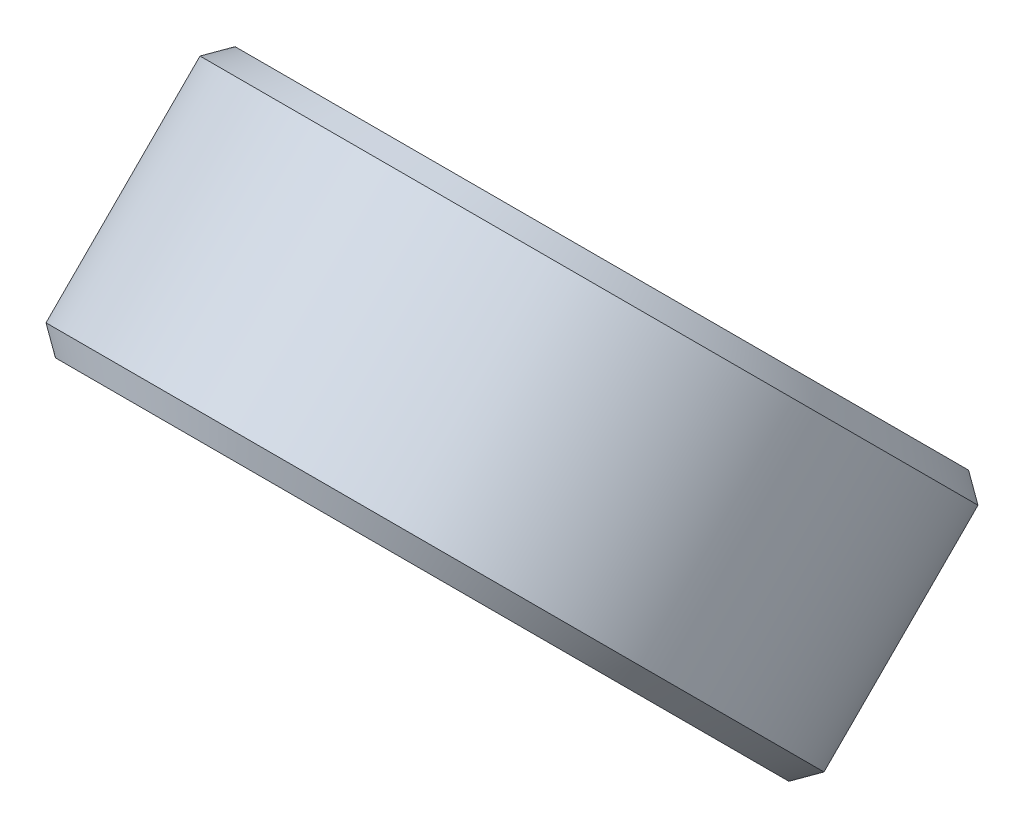
ISO-10303-21;
HEADER;
FILE_DESCRIPTION(('STEP AP214'),'2;1');
FILE_NAME('part.step','',(''),(''),'','','');
FILE_SCHEMA(('AUTOMOTIVE_DESIGN { 1 0 10303 214 1 1 1 1 }'));
ENDSEC;
DATA;
#1=APPLICATION_CONTEXT('core data for automotive mechanical design processes');
#2=APPLICATION_PROTOCOL_DEFINITION('international standard','automotive_design',2000,#1);
#3=PRODUCT_CONTEXT('',#1,'mechanical');
#4=PRODUCT('Part','Part','',(#3));
#5=PRODUCT_RELATED_PRODUCT_CATEGORY('part','',(#4));
#6=PRODUCT_DEFINITION_FORMATION('','',#4);
#7=PRODUCT_DEFINITION_CONTEXT('part definition',#1,'design');
#8=PRODUCT_DEFINITION('design','',#6,#7);
#9=PRODUCT_DEFINITION_SHAPE('','',#8);
#10=(LENGTH_UNIT() NAMED_UNIT(*) SI_UNIT(.MILLI.,.METRE.));
#11=(NAMED_UNIT(*) PLANE_ANGLE_UNIT() SI_UNIT($,.RADIAN.));
#12=(NAMED_UNIT(*) SI_UNIT($,.STERADIAN.) SOLID_ANGLE_UNIT());
#13=UNCERTAINTY_MEASURE_WITH_UNIT(LENGTH_MEASURE(1.E-05),#10,'distance_accuracy_value','');
#14=(GEOMETRIC_REPRESENTATION_CONTEXT(3) GLOBAL_UNCERTAINTY_ASSIGNED_CONTEXT((#13)) GLOBAL_UNIT_ASSIGNED_CONTEXT((#10,
#11,#12)) REPRESENTATION_CONTEXT('',''));
#15=CARTESIAN_POINT('',(0.,0.,0.));
#16=DIRECTION('',(0.,0.,1.));
#17=DIRECTION('',(1.,0.,0.));
#18=AXIS2_PLACEMENT_3D('',#15,#16,#17);
#19=CARTESIAN_POINT('',(0.,176.776695296637,176.776695296637));
#20=DIRECTION('',(0.,0.707106781186544,-0.707106781186552));
#21=DIRECTION('',(0.,0.707106781186552,0.707106781186544));
#22=AXIS2_PLACEMENT_3D('',#19,#20,#21);
#23=CYLINDRICAL_SURFACE('',#22,13.4999999999989);
#24=CARTESIAN_POINT('',(0.,36.2392225358109,317.314168057464));
#25=DIRECTION('',(0.,0.707106781186544,-0.707106781186552));
#26=DIRECTION('',(0.,0.707106781186552,0.707106781186544));
#27=AXIS2_PLACEMENT_3D('',#24,#25,#26);
#28=CIRCLE('',#27,13.4999999999988);
#29=CARTESIAN_POINT('',(-4.86691280225608,45.1432429697275,326.218188491381));
#30=VERTEX_POINT('',#29);
#31=CARTESIAN_POINT('',(4.86691280225606,45.1432429697275,326.218188491381));
#32=VERTEX_POINT('',#31);
#33=EDGE_CURVE('E230',#30,#32,#28,.T.);
#34=ORIENTED_EDGE('',*,*,#33,.T.);
#35=DIRECTION('',(0.,0.707106781186544,-0.707106781186552));
#36=VECTOR('',#35,1.);
#37=CARTESIAN_POINT('',(4.86691280225609,185.680715730554,185.680715730553));
#38=LINE('',#37,#36);
#39=CARTESIAN_POINT('',(4.86691280225607,36.6579615954889,334.703469865619));
#40=VERTEX_POINT('',#39);
#41=EDGE_CURVE('E152',#32,#40,#38,.F.);
#42=ORIENTED_EDGE('',*,*,#41,.T.);
#43=CARTESIAN_POINT('',(0.,27.7539411615724,325.799449431703));
#44=DIRECTION('',(0.,0.707106781186544,-0.707106781186552));
#45=DIRECTION('',(0.,0.707106781186552,0.707106781186544));
#46=AXIS2_PLACEMENT_3D('',#43,#44,#45);
#47=CIRCLE('',#46,13.4999999999989);
#48=CARTESIAN_POINT('',(-4.86691280225607,36.6579615954889,334.703469865619));
#49=VERTEX_POINT('',#48);
#50=EDGE_CURVE('E218',#49,#40,#47,.T.);
#51=ORIENTED_EDGE('',*,*,#50,.F.);
#52=DIRECTION('',(0.,0.707106781186544,-0.707106781186552));
#53=VECTOR('',#52,1.);
#54=CARTESIAN_POINT('',(-4.86691280225608,185.680715730554,185.680715730553));
#55=LINE('',#54,#53);
#56=EDGE_CURVE('E149',#49,#30,#55,.T.);
#57=ORIENTED_EDGE('',*,*,#56,.T.);
#58=EDGE_LOOP('',(#34,#42,#51,#57));
#59=FACE_BOUND('',#58,.T.);
#60=ADVANCED_FACE('F39',(#59),#23,.F.);
#61=CARTESIAN_POINT('',(10.4800583067826,33.7713483227344,331.816856592865));
#62=VERTEX_POINT('',#61);
#63=CARTESIAN_POINT('',(10.4800583067826,21.7365340004104,319.782042270541));
#64=VERTEX_POINT('',#63);
#65=EDGE_CURVE('E228',#62,#64,#47,.T.);
#66=ORIENTED_EDGE('',*,*,#65,.F.);
#67=DIRECTION('',(0.,0.707106781186544,-0.707106781186552));
#68=VECTOR('',#67,1.);
#69=CARTESIAN_POINT('',(10.4800583067826,182.794102457799,182.794102457799));
#70=LINE('',#69,#68);
#71=CARTESIAN_POINT('',(10.4800583067825,42.256629696973,323.331575218626));
#72=VERTEX_POINT('',#71);
#73=EDGE_CURVE('E135',#62,#72,#70,.T.);
#74=ORIENTED_EDGE('',*,*,#73,.T.);
#75=CARTESIAN_POINT('',(10.4800583067826,30.221815374649,311.296760896302));
#76=VERTEX_POINT('',#75);
#77=EDGE_CURVE('E232',#72,#76,#28,.T.);
#78=ORIENTED_EDGE('',*,*,#77,.T.);
#79=DIRECTION('',(0.,0.707106781186544,-0.707106781186552));
#80=VECTOR('',#79,1.);
#81=CARTESIAN_POINT('',(10.4800583067826,170.759288135475,170.759288135475));
#82=LINE('',#81,#80);
#83=EDGE_CURVE('E132',#76,#64,#82,.F.);
#84=ORIENTED_EDGE('',*,*,#83,.T.);
#85=EDGE_LOOP('',(#66,#74,#78,#84));
#86=FACE_BOUND('',#85,.T.);
#87=ADVANCED_FACE('F411',(#86),#23,.F.);
#88=CARTESIAN_POINT('',(4.86691280225619,27.3352021018944,308.410147623548));
#89=VERTEX_POINT('',#88);
#90=CARTESIAN_POINT('',(-4.86691280225618,27.3352021018944,308.410147623548));
#91=VERTEX_POINT('',#90);
#92=EDGE_CURVE('E121',#89,#91,#28,.T.);
#93=ORIENTED_EDGE('',*,*,#92,.T.);
#94=DIRECTION('',(0.,0.707106781186544,-0.707106781186552));
#95=VECTOR('',#94,1.);
#96=CARTESIAN_POINT('',(-4.86691280225618,167.872674862721,167.87267486272));
#97=LINE('',#96,#95);
#98=CARTESIAN_POINT('',(-4.86691280225618,18.8499207276559,316.895428997787));
#99=VERTEX_POINT('',#98);
#100=EDGE_CURVE('E137',#91,#99,#97,.F.);
#101=ORIENTED_EDGE('',*,*,#100,.T.);
#102=CARTESIAN_POINT('',(4.86691280225619,18.8499207276559,316.895428997787));
#103=VERTEX_POINT('',#102);
#104=EDGE_CURVE('E225',#103,#99,#47,.T.);
#105=ORIENTED_EDGE('',*,*,#104,.F.);
#106=DIRECTION('',(0.,0.707106781186544,-0.707106781186552));
#107=VECTOR('',#106,1.);
#108=CARTESIAN_POINT('',(4.86691280225619,167.872674862721,167.87267486272));
#109=LINE('',#108,#107);
#110=EDGE_CURVE('E275',#103,#89,#109,.T.);
#111=ORIENTED_EDGE('',*,*,#110,.T.);
#112=EDGE_LOOP('',(#93,#101,#105,#111));
#113=FACE_BOUND('',#112,.T.);
#114=ADVANCED_FACE('F281',(#113),#23,.F.);
#115=CARTESIAN_POINT('',(0.,-140.537472760829,140.537472760826));
#116=DIRECTION('',(0.,0.707106781186544,-0.707106781186552));
#117=DIRECTION('',(0.,0.707106781186552,0.707106781186544));
#118=AXIS2_PLACEMENT_3D('',#115,#116,#117);
#119=PLANE('',#118);
#120=CARTESIAN_POINT('',(0.,36.2392225358101,317.314168057464));
#121=DIRECTION('',(0.,0.707106781186544,-0.707106781186552));
#122=DIRECTION('',(0.,0.707106781186552,0.707106781186544));
#123=AXIS2_PLACEMENT_3D('',#120,#121,#122);
#124=CIRCLE('',#123,10.5000000000001);
#125=CARTESIAN_POINT('',(0.,43.6638437382689,324.738789259922));
#126=VERTEX_POINT('',#125);
#127=EDGE_CURVE('E215',#126,#126,#124,.F.);
#128=ORIENTED_EDGE('',*,*,#127,.F.);
#129=EDGE_LOOP('',(#128));
#130=FACE_BOUND('',#129,.T.);
#131=ORIENTED_EDGE('',*,*,#33,.F.);
#132=CARTESIAN_POINT('',(-5.22742486168249,45.8028000389066,326.87774556056));
#133=DIRECTION('',(0.,0.707106781186544,-0.707106781186552));
#134=DIRECTION('',(0.,0.707106781186552,0.707106781186544));
#135=AXIS2_PLACEMENT_3D('',#132,#133,#134);
#136=CIRCLE('',#135,1.);
#137=CARTESIAN_POINT('',(-5.96677823190049,45.3266925962283,326.401638117882));
#138=VERTEX_POINT('',#137);
#139=EDGE_CURVE('E168',#30,#138,#136,.T.);
#140=ORIENTED_EDGE('',*,*,#139,.T.);
#141=CARTESIAN_POINT('',(-8.00000000000001,44.017397128863,325.092342650516));
#142=DIRECTION('',(0.,-0.707106781186543,0.707106781186552));
#143=DIRECTION('',(0.,-0.707106781186552,-0.707106781186543));
#144=AXIS2_PLACEMENT_3D('',#141,#142,#143);
#145=CIRCLE('',#144,2.75);
#146=CARTESIAN_POINT('',(-10.3879965428732,43.0530391789229,324.127984700576));
#147=VERTEX_POINT('',#146);
#148=EDGE_CURVE('E56',#147,#138,#145,.T.);
#149=ORIENTED_EDGE('',*,*,#148,.F.);
#150=CARTESIAN_POINT('',(-11.2563589220998,42.7023635607628,323.777309082416));
#151=DIRECTION('',(0.,0.707106781186544,-0.707106781186552));
#152=DIRECTION('',(0.,0.707106781186552,0.707106781186544));
#153=AXIS2_PLACEMENT_3D('',#150,#151,#152);
#154=CIRCLE('',#153,1.);
#155=CARTESIAN_POINT('',(-10.4800583067825,42.256629696973,323.331575218626));
#156=VERTEX_POINT('',#155);
#157=EDGE_CURVE('E170',#147,#156,#154,.T.);
#158=ORIENTED_EDGE('',*,*,#157,.T.);
#159=CARTESIAN_POINT('',(-10.4800583067826,30.2218153746489,311.296760896302));
#160=VERTEX_POINT('',#159);
#161=EDGE_CURVE('E231',#160,#156,#28,.T.);
#162=ORIENTED_EDGE('',*,*,#161,.F.);
#163=CARTESIAN_POINT('',(-11.2563589220998,29.7760815108591,310.851027032513));
#164=DIRECTION('',(0.,0.707106781186544,-0.707106781186552));
#165=DIRECTION('',(0.,0.707106781186552,0.707106781186544));
#166=AXIS2_PLACEMENT_3D('',#163,#164,#165);
#167=CIRCLE('',#166,1.);
#168=CARTESIAN_POINT('',(-10.3879965428732,29.4254058926991,310.500351414353));
#169=VERTEX_POINT('',#168);
#170=EDGE_CURVE('E161',#160,#169,#167,.T.);
#171=ORIENTED_EDGE('',*,*,#170,.T.);
#172=CARTESIAN_POINT('',(-7.99999999999998,28.4610479427589,309.535993464412));
#173=DIRECTION('',(0.,-0.707106781186543,0.707106781186552));
#174=DIRECTION('',(0.,-0.707106781186552,-0.707106781186543));
#175=AXIS2_PLACEMENT_3D('',#172,#173,#174);
#176=CIRCLE('',#175,2.75);
#177=CARTESIAN_POINT('',(-5.96677823190056,27.1517524753936,308.226697997047));
#178=VERTEX_POINT('',#177);
#179=EDGE_CURVE('E303',#178,#169,#176,.T.);
#180=ORIENTED_EDGE('',*,*,#179,.F.);
#181=CARTESIAN_POINT('',(-5.22742486168259,26.6756450327154,307.750590554369));
#182=DIRECTION('',(0.,0.707106781186544,-0.707106781186552));
#183=DIRECTION('',(0.,0.707106781186552,0.707106781186544));
#184=AXIS2_PLACEMENT_3D('',#181,#182,#183);
#185=CIRCLE('',#184,1.);
#186=EDGE_CURVE('E126',#178,#91,#185,.T.);
#187=ORIENTED_EDGE('',*,*,#186,.T.);
#188=ORIENTED_EDGE('',*,*,#92,.F.);
#189=CARTESIAN_POINT('',(5.2274248616826,26.6756450327154,307.750590554369));
#190=DIRECTION('',(0.,0.707106781186544,-0.707106781186552));
#191=DIRECTION('',(0.,0.707106781186552,0.707106781186544));
#192=AXIS2_PLACEMENT_3D('',#189,#190,#191);
#193=CIRCLE('',#192,1.);
#194=CARTESIAN_POINT('',(5.96677823190057,27.1517524753937,308.226697997047));
#195=VERTEX_POINT('',#194);
#196=EDGE_CURVE('E116',#89,#195,#193,.T.);
#197=ORIENTED_EDGE('',*,*,#196,.T.);
#198=CARTESIAN_POINT('',(8.00000000000004,28.4610479427589,309.535993464412));
#199=DIRECTION('',(0.,-0.707106781186543,0.707106781186552));
#200=DIRECTION('',(0.,-0.707106781186552,-0.707106781186543));
#201=AXIS2_PLACEMENT_3D('',#198,#199,#200);
#202=CIRCLE('',#201,2.75);
#203=CARTESIAN_POINT('',(10.3879965428733,29.4254058926991,310.500351414353));
#204=VERTEX_POINT('',#203);
#205=EDGE_CURVE('E93',#204,#195,#202,.T.);
#206=ORIENTED_EDGE('',*,*,#205,.F.);
#207=CARTESIAN_POINT('',(11.2563589220999,29.7760815108592,310.851027032513));
#208=DIRECTION('',(0.,0.707106781186544,-0.707106781186552));
#209=DIRECTION('',(0.,0.707106781186552,0.707106781186544));
#210=AXIS2_PLACEMENT_3D('',#207,#208,#209);
#211=CIRCLE('',#210,1.);
#212=EDGE_CURVE('E172',#204,#76,#211,.T.);
#213=ORIENTED_EDGE('',*,*,#212,.T.);
#214=ORIENTED_EDGE('',*,*,#77,.F.);
#215=CARTESIAN_POINT('',(11.2563589220998,42.7023635607628,323.777309082416));
#216=DIRECTION('',(0.,0.707106781186544,-0.707106781186552));
#217=DIRECTION('',(0.,0.707106781186552,0.707106781186544));
#218=AXIS2_PLACEMENT_3D('',#215,#216,#217);
#219=CIRCLE('',#218,1.);
#220=CARTESIAN_POINT('',(10.3879965428732,43.0530391789229,324.127984700576));
#221=VERTEX_POINT('',#220);
#222=EDGE_CURVE('E125',#72,#221,#219,.T.);
#223=ORIENTED_EDGE('',*,*,#222,.T.);
#224=CARTESIAN_POINT('',(8.00000000000001,44.017397128863,325.092342650516));
#225=DIRECTION('',(0.,-0.707106781186543,0.707106781186552));
#226=DIRECTION('',(0.,-0.707106781186552,-0.707106781186543));
#227=AXIS2_PLACEMENT_3D('',#224,#225,#226);
#228=CIRCLE('',#227,2.75);
#229=CARTESIAN_POINT('',(5.96677823190047,45.3266925962283,326.401638117882));
#230=VERTEX_POINT('',#229);
#231=EDGE_CURVE('E239',#230,#221,#228,.T.);
#232=ORIENTED_EDGE('',*,*,#231,.F.);
#233=CARTESIAN_POINT('',(5.22742486168248,45.8028000389065,326.87774556056));
#234=DIRECTION('',(0.,0.707106781186544,-0.707106781186552));
#235=DIRECTION('',(0.,0.707106781186552,0.707106781186544));
#236=AXIS2_PLACEMENT_3D('',#233,#234,#235);
#237=CIRCLE('',#236,1.);
#238=EDGE_CURVE('E78',#230,#32,#237,.T.);
#239=ORIENTED_EDGE('',*,*,#238,.T.);
#240=EDGE_LOOP('',(#131,#140,#149,#158,#162,#171,#180,#187,#188,#197,#206,#213,#214,#223,#232,#239));
#241=FACE_BOUND('',#240,.T.);
#242=ADVANCED_FACE('F117',(#130,#241),#119,.F.);
#243=CARTESIAN_POINT('',(-10.4800583067826,21.7365340004104,319.782042270541));
#244=VERTEX_POINT('',#243);
#245=CARTESIAN_POINT('',(-10.4800583067825,33.7713483227344,331.816856592865));
#246=VERTEX_POINT('',#245);
#247=EDGE_CURVE('E229',#244,#246,#47,.T.);
#248=ORIENTED_EDGE('',*,*,#247,.F.);
#249=DIRECTION('',(0.,0.707106781186544,-0.707106781186552));
#250=VECTOR('',#249,1.);
#251=CARTESIAN_POINT('',(-10.4800583067826,170.759288135475,170.759288135475));
#252=LINE('',#251,#250);
#253=EDGE_CURVE('E244',#244,#160,#252,.T.);
#254=ORIENTED_EDGE('',*,*,#253,.T.);
#255=ORIENTED_EDGE('',*,*,#161,.T.);
#256=DIRECTION('',(0.,0.707106781186544,-0.707106781186552));
#257=VECTOR('',#256,1.);
#258=CARTESIAN_POINT('',(-10.4800583067825,182.794102457799,182.794102457799));
#259=LINE('',#258,#257);
#260=EDGE_CURVE('E241',#156,#246,#259,.F.);
#261=ORIENTED_EDGE('',*,*,#260,.T.);
#262=EDGE_LOOP('',(#248,#254,#255,#261));
#263=FACE_BOUND('',#262,.T.);
#264=ADVANCED_FACE('F194',(#263),#23,.F.);
#265=CARTESIAN_POINT('',(0.,-139.123259198454,139.123259198455));
#266=DIRECTION('',(0.,0.707106781186544,-0.707106781186552));
#267=DIRECTION('',(0.,0.707106781186552,0.707106781186544));
#268=AXIS2_PLACEMENT_3D('',#265,#266,#267);
#269=PLANE('',#268);
#270=CARTESIAN_POINT('',(0.,37.653436098184,315.899954495091));
#271=DIRECTION('',(0.,0.707106781186544,-0.707106781186552));
#272=DIRECTION('',(0.,0.707106781186552,0.707106781186544));
#273=AXIS2_PLACEMENT_3D('',#270,#271,#272);
#274=CIRCLE('',#273,16.4999999999993);
#275=CARTESIAN_POINT('',(0.,49.3206979877616,327.567216384669));
#276=VERTEX_POINT('',#275);
#277=EDGE_CURVE('E174',#276,#276,#274,.T.);
#278=ORIENTED_EDGE('',*,*,#277,.T.);
#279=EDGE_LOOP('',(#278));
#280=FACE_BOUND('',#279,.T.);
#281=CARTESIAN_POINT('',(-8.00000000000001,45.4316106912362,323.678129088143));
#282=DIRECTION('',(0.,0.707106781186544,-0.707106781186552));
#283=DIRECTION('',(0.,0.707106781186552,0.707106781186544));
#284=AXIS2_PLACEMENT_3D('',#281,#282,#283);
#285=CIRCLE('',#284,1.35);
#286=CARTESIAN_POINT('',(-8.00000000000001,46.386204845838,324.632723242745));
#287=VERTEX_POINT('',#286);
#288=EDGE_CURVE('E199',#287,#287,#285,.T.);
#289=ORIENTED_EDGE('',*,*,#288,.F.);
#290=EDGE_LOOP('',(#289));
#291=FACE_BOUND('',#290,.T.);
#292=CARTESIAN_POINT('',(8.00000000000001,45.4316106912362,323.678129088143));
#293=DIRECTION('',(0.,0.707106781186544,-0.707106781186552));
#294=DIRECTION('',(0.,0.707106781186552,0.707106781186544));
#295=AXIS2_PLACEMENT_3D('',#292,#293,#294);
#296=CIRCLE('',#295,1.35);
#297=CARTESIAN_POINT('',(8.00000000000001,46.386204845838,324.632723242745));
#298=VERTEX_POINT('',#297);
#299=EDGE_CURVE('E113',#298,#298,#296,.T.);
#300=ORIENTED_EDGE('',*,*,#299,.F.);
#301=EDGE_LOOP('',(#300));
#302=FACE_BOUND('',#301,.T.);
#303=CARTESIAN_POINT('',(8.00000000000004,29.875261505132,308.121779902039));
#304=DIRECTION('',(0.,0.707106781186544,-0.707106781186552));
#305=DIRECTION('',(0.,0.707106781186552,0.707106781186544));
#306=AXIS2_PLACEMENT_3D('',#303,#304,#305);
#307=CIRCLE('',#306,1.35);
#308=CARTESIAN_POINT('',(8.00000000000004,30.8298556597339,309.076374056641));
#309=VERTEX_POINT('',#308);
#310=EDGE_CURVE('E206',#309,#309,#307,.T.);
#311=ORIENTED_EDGE('',*,*,#310,.F.);
#312=EDGE_LOOP('',(#311));
#313=FACE_BOUND('',#312,.T.);
#314=CARTESIAN_POINT('',(-7.99999999999998,29.875261505132,308.121779902039));
#315=DIRECTION('',(0.,0.707106781186544,-0.707106781186552));
#316=DIRECTION('',(0.,0.707106781186552,0.707106781186544));
#317=AXIS2_PLACEMENT_3D('',#314,#315,#316);
#318=CIRCLE('',#317,1.35);
#319=CARTESIAN_POINT('',(-7.99999999999998,30.8298556597339,309.076374056641));
#320=VERTEX_POINT('',#319);
#321=EDGE_CURVE('E210',#320,#320,#318,.T.);
#322=ORIENTED_EDGE('',*,*,#321,.F.);
#323=EDGE_LOOP('',(#322));
#324=FACE_BOUND('',#323,.T.);
#325=CARTESIAN_POINT('',(0.,37.6534360981832,315.89995449509));
#326=DIRECTION('',(0.,0.707106781186543,-0.707106781186552));
#327=DIRECTION('',(0.,0.707106781186552,0.707106781186543));
#328=AXIS2_PLACEMENT_3D('',#325,#326,#327);
#329=CIRCLE('',#328,10.5000000000001);
#330=CARTESIAN_POINT('',(0.,45.0780573006421,323.324575697549));
#331=VERTEX_POINT('',#330);
#332=EDGE_CURVE('E213',#331,#331,#329,.T.);
#333=ORIENTED_EDGE('',*,*,#332,.F.);
#334=EDGE_LOOP('',(#333));
#335=FACE_BOUND('',#334,.T.);
#336=ADVANCED_FACE('F191',(#280,#291,#302,#313,#324,#335),#269,.T.);
#337=CARTESIAN_POINT('',(0.,176.776695296637,176.776695296637));
#338=DIRECTION('',(0.,0.707106781186544,-0.707106781186552));
#339=DIRECTION('',(0.,0.707106781186552,0.707106781186544));
#340=AXIS2_PLACEMENT_3D('',#337,#338,#339);
#341=CYLINDRICAL_SURFACE('',#340,17.4999999999989);
#342=CARTESIAN_POINT('',(0.,36.9463293169975,316.607061276278));
#343=DIRECTION('',(0.,0.707106781186534,-0.707106781186561));
#344=DIRECTION('',(0.,0.707106781186561,0.707106781186534));
#345=AXIS2_PLACEMENT_3D('',#342,#343,#344);
#346=CIRCLE('',#345,17.4999999999989);
#347=CARTESIAN_POINT('',(0.,49.3206979877616,328.981429947041));
#348=VERTEX_POINT('',#347);
#349=EDGE_CURVE('E49',#348,#348,#346,.F.);
#350=ORIENTED_EDGE('',*,*,#349,.T.);
#351=EDGE_LOOP('',(#350));
#352=FACE_BOUND('',#351,.T.);
#353=CARTESIAN_POINT('',(0.,28.461047942759,325.092342650516));
#354=DIRECTION('',(0.,0.707106781186575,-0.70710678118652));
#355=DIRECTION('',(0.,0.70710678118652,0.707106781186575));
#356=AXIS2_PLACEMENT_3D('',#353,#354,#355);
#357=CIRCLE('',#356,17.4999999999989);
#358=CARTESIAN_POINT('',(0.,40.8354166135223,337.466711321281));
#359=VERTEX_POINT('',#358);
#360=EDGE_CURVE('E177',#359,#359,#357,.T.);
#361=ORIENTED_EDGE('',*,*,#360,.T.);
#362=EDGE_LOOP('',(#361));
#363=FACE_BOUND('',#362,.T.);
#364=ADVANCED_FACE('F182',(#352,#363),#341,.T.);
#365=CARTESIAN_POINT('',(0.,-149.022754135066,149.022754135066));
#366=DIRECTION('',(0.,0.707106781186544,-0.707106781186552));
#367=DIRECTION('',(0.,0.707106781186552,0.707106781186544));
#368=AXIS2_PLACEMENT_3D('',#365,#366,#367);
#369=PLANE('',#368);
#370=CARTESIAN_POINT('',(0.,27.7539411615724,325.799449431703));
#371=DIRECTION('',(0.,0.707106781186544,-0.707106781186552));
#372=DIRECTION('',(0.,0.707106781186552,0.707106781186544));
#373=AXIS2_PLACEMENT_3D('',#370,#371,#372);
#374=CIRCLE('',#373,16.4999999999995);
#375=CARTESIAN_POINT('',(0.,39.4212030511501,337.466711321281));
#376=VERTEX_POINT('',#375);
#377=EDGE_CURVE('E11',#376,#376,#374,.F.);
#378=ORIENTED_EDGE('',*,*,#377,.T.);
#379=EDGE_LOOP('',(#378));
#380=FACE_BOUND('',#379,.T.);
#381=CARTESIAN_POINT('',(-7.99999999999998,19.9757665685204,318.021274838651));
#382=DIRECTION('',(0.,0.707106781186544,-0.707106781186552));
#383=DIRECTION('',(0.,0.707106781186552,0.707106781186544));
#384=AXIS2_PLACEMENT_3D('',#381,#382,#383);
#385=CIRCLE('',#384,2.74999999999997);
#386=CARTESIAN_POINT('',(-5.96677823190058,18.6664711011551,316.711979371286));
#387=VERTEX_POINT('',#386);
#388=CARTESIAN_POINT('',(-10.3879965428732,20.9401245184606,318.985632788591));
#389=VERTEX_POINT('',#388);
#390=EDGE_CURVE('E300',#387,#389,#385,.T.);
#391=ORIENTED_EDGE('',*,*,#390,.T.);
#392=CARTESIAN_POINT('',(-11.2563589220998,21.2908001366206,319.336308406751));
#393=DIRECTION('',(0.,0.707106781186544,-0.707106781186552));
#394=DIRECTION('',(0.,0.707106781186552,0.707106781186544));
#395=AXIS2_PLACEMENT_3D('',#392,#393,#394);
#396=CIRCLE('',#395,1.);
#397=EDGE_CURVE('E272',#389,#244,#396,.F.);
#398=ORIENTED_EDGE('',*,*,#397,.T.);
#399=ORIENTED_EDGE('',*,*,#247,.T.);
#400=CARTESIAN_POINT('',(-11.2563589220998,34.2170821865243,332.262590456655));
#401=DIRECTION('',(0.,0.707106781186544,-0.707106781186552));
#402=DIRECTION('',(0.,0.707106781186552,0.707106781186544));
#403=AXIS2_PLACEMENT_3D('',#400,#401,#402);
#404=CIRCLE('',#403,1.);
#405=CARTESIAN_POINT('',(-10.3879965428732,34.5677578046843,332.613266074815));
#406=VERTEX_POINT('',#405);
#407=EDGE_CURVE('E256',#246,#406,#404,.F.);
#408=ORIENTED_EDGE('',*,*,#407,.T.);
#409=CARTESIAN_POINT('',(-8.00000000000001,35.5321157546245,333.577624024755));
#410=DIRECTION('',(0.,0.707106781186544,-0.707106781186552));
#411=DIRECTION('',(0.,0.707106781186552,0.707106781186544));
#412=AXIS2_PLACEMENT_3D('',#409,#410,#411);
#413=CIRCLE('',#412,2.75000000000001);
#414=CARTESIAN_POINT('',(-5.9667782319005,36.8414112219898,334.88691949212));
#415=VERTEX_POINT('',#414);
#416=EDGE_CURVE('E322',#406,#415,#413,.T.);
#417=ORIENTED_EDGE('',*,*,#416,.T.);
#418=CARTESIAN_POINT('',(-5.22742486168249,37.317518664668,335.363026934799));
#419=DIRECTION('',(0.,0.707106781186544,-0.707106781186552));
#420=DIRECTION('',(0.,0.707106781186552,0.707106781186544));
#421=AXIS2_PLACEMENT_3D('',#418,#419,#420);
#422=CIRCLE('',#421,1.);
#423=EDGE_CURVE('E259',#415,#49,#422,.F.);
#424=ORIENTED_EDGE('',*,*,#423,.T.);
#425=ORIENTED_EDGE('',*,*,#50,.T.);
#426=CARTESIAN_POINT('',(5.22742486168248,37.317518664668,335.363026934798));
#427=DIRECTION('',(0.,0.707106781186544,-0.707106781186552));
#428=DIRECTION('',(0.,0.707106781186552,0.707106781186544));
#429=AXIS2_PLACEMENT_3D('',#426,#427,#428);
#430=CIRCLE('',#429,1.);
#431=CARTESIAN_POINT('',(5.9667782319005,36.8414112219898,334.88691949212));
#432=VERTEX_POINT('',#431);
#433=EDGE_CURVE('E262',#40,#432,#430,.F.);
#434=ORIENTED_EDGE('',*,*,#433,.T.);
#435=CARTESIAN_POINT('',(8.00000000000001,35.5321157546245,333.577624024755));
#436=DIRECTION('',(0.,0.707106781186544,-0.707106781186552));
#437=DIRECTION('',(0.,0.707106781186552,0.707106781186544));
#438=AXIS2_PLACEMENT_3D('',#435,#436,#437);
#439=CIRCLE('',#438,2.75);
#440=CARTESIAN_POINT('',(10.3879965428732,34.5677578046844,332.613266074815));
#441=VERTEX_POINT('',#440);
#442=EDGE_CURVE('E319',#432,#441,#439,.T.);
#443=ORIENTED_EDGE('',*,*,#442,.T.);
#444=CARTESIAN_POINT('',(11.2563589220998,34.2170821865243,332.262590456655));
#445=DIRECTION('',(0.,0.707106781186544,-0.707106781186552));
#446=DIRECTION('',(0.,0.707106781186552,0.707106781186544));
#447=AXIS2_PLACEMENT_3D('',#444,#445,#446);
#448=CIRCLE('',#447,1.);
#449=EDGE_CURVE('E265',#441,#62,#448,.F.);
#450=ORIENTED_EDGE('',*,*,#449,.T.);
#451=ORIENTED_EDGE('',*,*,#65,.T.);
#452=CARTESIAN_POINT('',(11.2563589220999,21.2908001366206,319.336308406751));
#453=DIRECTION('',(0.,0.707106781186544,-0.707106781186552));
#454=DIRECTION('',(0.,0.707106781186552,0.707106781186544));
#455=AXIS2_PLACEMENT_3D('',#452,#453,#454);
#456=CIRCLE('',#455,1.);
#457=CARTESIAN_POINT('',(10.3879965428733,20.9401245184606,318.985632788591));
#458=VERTEX_POINT('',#457);
#459=EDGE_CURVE('E253',#64,#458,#456,.F.);
#460=ORIENTED_EDGE('',*,*,#459,.T.);
#461=CARTESIAN_POINT('',(8.00000000000004,19.9757665685204,318.021274838651));
#462=DIRECTION('',(0.,0.707106781186544,-0.707106781186552));
#463=DIRECTION('',(0.,0.707106781186552,0.707106781186544));
#464=AXIS2_PLACEMENT_3D('',#461,#462,#463);
#465=CIRCLE('',#464,2.74999999999999);
#466=CARTESIAN_POINT('',(5.96677823190056,18.6664711011552,316.711979371286));
#467=VERTEX_POINT('',#466);
#468=EDGE_CURVE('E317',#458,#467,#465,.T.);
#469=ORIENTED_EDGE('',*,*,#468,.T.);
#470=CARTESIAN_POINT('',(5.2274248616826,18.1903636584769,316.235871928608));
#471=DIRECTION('',(0.,0.707106781186544,-0.707106781186552));
#472=DIRECTION('',(0.,0.707106781186552,0.707106781186544));
#473=AXIS2_PLACEMENT_3D('',#470,#471,#472);
#474=CIRCLE('',#473,1.);
#475=EDGE_CURVE('E131',#467,#103,#474,.F.);
#476=ORIENTED_EDGE('',*,*,#475,.T.);
#477=ORIENTED_EDGE('',*,*,#104,.T.);
#478=CARTESIAN_POINT('',(-5.22742486168259,18.1903636584769,316.235871928608));
#479=DIRECTION('',(0.,0.707106781186544,-0.707106781186552));
#480=DIRECTION('',(0.,0.707106781186552,0.707106781186544));
#481=AXIS2_PLACEMENT_3D('',#478,#479,#480);
#482=CIRCLE('',#481,1.);
#483=EDGE_CURVE('E269',#99,#387,#482,.F.);
#484=ORIENTED_EDGE('',*,*,#483,.T.);
#485=EDGE_LOOP('',(#391,#398,#399,#408,#417,#424,#425,#434,#443,#450,#451,#460,#469,#476,#477,#484));
#486=FACE_BOUND('',#485,.T.);
#487=ADVANCED_FACE('F290',(#380,#486),#369,.F.);
#488=CARTESIAN_POINT('',(0.,1.23922253581244,352.314168057462));
#489=DIRECTION('',(0.,0.707106781186543,-0.707106781186552));
#490=DIRECTION('',(0.,0.707106781186552,0.707106781186543));
#491=AXIS2_PLACEMENT_3D('',#488,#489,#490);
#492=CYLINDRICAL_SURFACE('',#491,10.5000000000001);
#493=ORIENTED_EDGE('',*,*,#127,.T.);
#494=EDGE_LOOP('',(#493));
#495=FACE_BOUND('',#494,.T.);
#496=ORIENTED_EDGE('',*,*,#332,.T.);
#497=EDGE_LOOP('',(#496));
#498=FACE_BOUND('',#497,.T.);
#499=ADVANCED_FACE('F484',(#495,#498),#492,.F.);
#500=CARTESIAN_POINT('',(-7.99999999999998,28.4610479427589,309.535993464412));
#501=DIRECTION('',(0.,-0.707106781186543,0.707106781186552));
#502=DIRECTION('',(0.,-0.707106781186552,-0.707106781186543));
#503=AXIS2_PLACEMENT_3D('',#500,#501,#502);
#504=CYLINDRICAL_SURFACE('',#503,1.35);
#505=ORIENTED_EDGE('',*,*,#321,.T.);
#506=EDGE_LOOP('',(#505));
#507=FACE_BOUND('',#506,.T.);
#508=CARTESIAN_POINT('',(-7.99999999999998,29.4509974364201,308.546043970751));
#509=DIRECTION('',(0.,-0.707106781186543,0.707106781186552));
#510=DIRECTION('',(0.,-0.707106781186552,-0.707106781186543));
#511=AXIS2_PLACEMENT_3D('',#508,#509,#510);
#512=CIRCLE('',#511,1.35);
#513=CARTESIAN_POINT('',(-7.99999999999998,28.4964032818183,307.59144981615));
#514=VERTEX_POINT('',#513);
#515=EDGE_CURVE('E220',#514,#514,#512,.T.);
#516=ORIENTED_EDGE('',*,*,#515,.T.);
#517=EDGE_LOOP('',(#516));
#518=FACE_BOUND('',#517,.T.);
#519=ADVANCED_FACE('F495',(#507,#518),#504,.F.);
#520=CARTESIAN_POINT('',(-7.99999999999998,28.4610479427589,309.535993464412));
#521=DIRECTION('',(0.,-0.707106781186543,0.707106781186552));
#522=DIRECTION('',(0.,-0.707106781186552,-0.707106781186543));
#523=AXIS2_PLACEMENT_3D('',#520,#521,#522);
#524=CONICAL_SURFACE('',#523,2.75,0.785398163397455);
#525=ORIENTED_EDGE('',*,*,#515,.F.);
#526=EDGE_LOOP('',(#525));
#527=FACE_BOUND('',#526,.T.);
#528=ORIENTED_EDGE('',*,*,#179,.T.);
#529=EDGE_CURVE('E235',#169,#178,#176,.T.);
#530=ORIENTED_EDGE('',*,*,#529,.T.);
#531=EDGE_LOOP('',(#528,#530));
#532=FACE_BOUND('',#531,.T.);
#533=ADVANCED_FACE('F302',(#527,#532),#524,.F.);
#534=CARTESIAN_POINT('',(8.00000000000004,28.4610479427589,309.535993464412));
#535=DIRECTION('',(0.,-0.707106781186543,0.707106781186552));
#536=DIRECTION('',(0.,-0.707106781186552,-0.707106781186543));
#537=AXIS2_PLACEMENT_3D('',#534,#535,#536);
#538=CYLINDRICAL_SURFACE('',#537,1.35);
#539=ORIENTED_EDGE('',*,*,#310,.T.);
#540=EDGE_LOOP('',(#539));
#541=FACE_BOUND('',#540,.T.);
#542=CARTESIAN_POINT('',(8.00000000000004,29.4509974364201,308.546043970751));
#543=DIRECTION('',(0.,-0.707106781186543,0.707106781186552));
#544=DIRECTION('',(0.,-0.707106781186552,-0.707106781186543));
#545=AXIS2_PLACEMENT_3D('',#542,#543,#544);
#546=CIRCLE('',#545,1.35);
#547=CARTESIAN_POINT('',(8.00000000000004,28.4964032818183,307.59144981615));
#548=VERTEX_POINT('',#547);
#549=EDGE_CURVE('E100',#548,#548,#546,.T.);
#550=ORIENTED_EDGE('',*,*,#549,.T.);
#551=EDGE_LOOP('',(#550));
#552=FACE_BOUND('',#551,.T.);
#553=ADVANCED_FACE('F515',(#541,#552),#538,.F.);
#554=CARTESIAN_POINT('',(8.00000000000004,28.4610479427589,309.535993464412));
#555=DIRECTION('',(0.,-0.707106781186543,0.707106781186552));
#556=DIRECTION('',(0.,-0.707106781186552,-0.707106781186543));
#557=AXIS2_PLACEMENT_3D('',#554,#555,#556);
#558=CONICAL_SURFACE('',#557,2.75,0.785398163397454);
#559=ORIENTED_EDGE('',*,*,#549,.F.);
#560=EDGE_LOOP('',(#559));
#561=FACE_BOUND('',#560,.T.);
#562=ORIENTED_EDGE('',*,*,#205,.T.);
#563=EDGE_CURVE('E96',#195,#204,#202,.T.);
#564=ORIENTED_EDGE('',*,*,#563,.T.);
#565=EDGE_LOOP('',(#562,#564));
#566=FACE_BOUND('',#565,.T.);
#567=ADVANCED_FACE('F95',(#561,#566),#558,.F.);
#568=CARTESIAN_POINT('',(8.00000000000001,44.017397128863,325.092342650516));
#569=DIRECTION('',(0.,-0.707106781186543,0.707106781186552));
#570=DIRECTION('',(0.,-0.707106781186552,-0.707106781186543));
#571=AXIS2_PLACEMENT_3D('',#568,#569,#570);
#572=CYLINDRICAL_SURFACE('',#571,1.35);
#573=ORIENTED_EDGE('',*,*,#299,.T.);
#574=EDGE_LOOP('',(#573));
#575=FACE_BOUND('',#574,.T.);
#576=CARTESIAN_POINT('',(8.00000000000001,45.0073466225242,324.102393156855));
#577=DIRECTION('',(0.,-0.707106781186543,0.707106781186552));
#578=DIRECTION('',(0.,-0.707106781186552,-0.707106781186543));
#579=AXIS2_PLACEMENT_3D('',#576,#577,#578);
#580=CIRCLE('',#579,1.35);
#581=CARTESIAN_POINT('',(8.00000000000001,44.0527524679224,323.147799002253));
#582=VERTEX_POINT('',#581);
#583=EDGE_CURVE('E237',#582,#582,#580,.T.);
#584=ORIENTED_EDGE('',*,*,#583,.T.);
#585=EDGE_LOOP('',(#584));
#586=FACE_BOUND('',#585,.T.);
#587=ADVANCED_FACE('F397',(#575,#586),#572,.F.);
#588=CARTESIAN_POINT('',(8.00000000000001,44.017397128863,325.092342650516));
#589=DIRECTION('',(0.,-0.707106781186543,0.707106781186552));
#590=DIRECTION('',(0.,-0.707106781186552,-0.707106781186543));
#591=AXIS2_PLACEMENT_3D('',#588,#589,#590);
#592=CONICAL_SURFACE('',#591,2.75,0.785398163397454);
#593=ORIENTED_EDGE('',*,*,#583,.F.);
#594=EDGE_LOOP('',(#593));
#595=FACE_BOUND('',#594,.T.);
#596=ORIENTED_EDGE('',*,*,#231,.T.);
#597=EDGE_CURVE('E309',#221,#230,#228,.T.);
#598=ORIENTED_EDGE('',*,*,#597,.T.);
#599=EDGE_LOOP('',(#596,#598));
#600=FACE_BOUND('',#599,.T.);
#601=ADVANCED_FACE('F394',(#595,#600),#592,.F.);
#602=CARTESIAN_POINT('',(-8.00000000000001,44.017397128863,325.092342650516));
#603=DIRECTION('',(0.,-0.707106781186543,0.707106781186552));
#604=DIRECTION('',(0.,-0.707106781186552,-0.707106781186543));
#605=AXIS2_PLACEMENT_3D('',#602,#603,#604);
#606=CYLINDRICAL_SURFACE('',#605,1.35);
#607=ORIENTED_EDGE('',*,*,#288,.T.);
#608=EDGE_LOOP('',(#607));
#609=FACE_BOUND('',#608,.T.);
#610=CARTESIAN_POINT('',(-8.00000000000001,45.0073466225242,324.102393156855));
#611=DIRECTION('',(0.,-0.707106781186543,0.707106781186552));
#612=DIRECTION('',(0.,-0.707106781186552,-0.707106781186543));
#613=AXIS2_PLACEMENT_3D('',#610,#611,#612);
#614=CIRCLE('',#613,1.35);
#615=CARTESIAN_POINT('',(-8.00000000000001,44.0527524679224,323.147799002253));
#616=VERTEX_POINT('',#615);
#617=EDGE_CURVE('E240',#616,#616,#614,.T.);
#618=ORIENTED_EDGE('',*,*,#617,.T.);
#619=EDGE_LOOP('',(#618));
#620=FACE_BOUND('',#619,.T.);
#621=ADVANCED_FACE('F396',(#609,#620),#606,.F.);
#622=CARTESIAN_POINT('',(-8.00000000000001,44.017397128863,325.092342650516));
#623=DIRECTION('',(0.,-0.707106781186543,0.707106781186552));
#624=DIRECTION('',(0.,-0.707106781186552,-0.707106781186543));
#625=AXIS2_PLACEMENT_3D('',#622,#623,#624);
#626=CONICAL_SURFACE('',#625,2.75,0.785398163397454);
#627=ORIENTED_EDGE('',*,*,#617,.F.);
#628=EDGE_LOOP('',(#627));
#629=FACE_BOUND('',#628,.T.);
#630=ORIENTED_EDGE('',*,*,#148,.T.);
#631=EDGE_CURVE('E314',#138,#147,#145,.T.);
#632=ORIENTED_EDGE('',*,*,#631,.T.);
#633=EDGE_LOOP('',(#630,#632));
#634=FACE_BOUND('',#633,.T.);
#635=ADVANCED_FACE('F404',(#629,#634),#626,.F.);
#636=CARTESIAN_POINT('',(-8.00000000000001,23.1577470838609,345.951992695519));
#637=DIRECTION('',(0.,0.707106781186544,-0.707106781186552));
#638=DIRECTION('',(0.,0.707106781186552,0.707106781186544));
#639=AXIS2_PLACEMENT_3D('',#636,#637,#638);
#640=CYLINDRICAL_SURFACE('',#639,2.75000000000001);
#641=ORIENTED_EDGE('',*,*,#631,.F.);
#642=DIRECTION('',(0.,0.707106781186544,-0.707106781186552));
#643=VECTOR('',#642,1.);
#644=CARTESIAN_POINT('',(-5.96677823190049,24.4670425512261,347.261288162884));
#645=LINE('',#644,#643);
#646=EDGE_CURVE('E158',#138,#415,#645,.F.);
#647=ORIENTED_EDGE('',*,*,#646,.T.);
#648=ORIENTED_EDGE('',*,*,#416,.F.);
#649=DIRECTION('',(0.,0.707106781186544,-0.707106781186552));
#650=VECTOR('',#649,1.);
#651=CARTESIAN_POINT('',(-10.3879965428732,22.1933891339207,344.987634745579));
#652=LINE('',#651,#650);
#653=EDGE_CURVE('E155',#406,#147,#652,.T.);
#654=ORIENTED_EDGE('',*,*,#653,.T.);
#655=EDGE_LOOP('',(#641,#647,#648,#654));
#656=FACE_BOUND('',#655,.T.);
#657=ADVANCED_FACE('F564',(#656),#640,.F.);
#658=CARTESIAN_POINT('',(8.00000000000001,23.1577470838609,345.951992695519));
#659=DIRECTION('',(0.,0.707106781186544,-0.707106781186552));
#660=DIRECTION('',(0.,0.707106781186552,0.707106781186544));
#661=AXIS2_PLACEMENT_3D('',#658,#659,#660);
#662=CYLINDRICAL_SURFACE('',#661,2.75);
#663=ORIENTED_EDGE('',*,*,#597,.F.);
#664=DIRECTION('',(0.,0.707106781186544,-0.707106781186552));
#665=VECTOR('',#664,1.);
#666=CARTESIAN_POINT('',(10.3879965428732,22.1933891339207,344.987634745579));
#667=LINE('',#666,#665);
#668=EDGE_CURVE('E146',#221,#441,#667,.F.);
#669=ORIENTED_EDGE('',*,*,#668,.T.);
#670=ORIENTED_EDGE('',*,*,#442,.F.);
#671=DIRECTION('',(0.,0.707106781186544,-0.707106781186552));
#672=VECTOR('',#671,1.);
#673=CARTESIAN_POINT('',(5.96677823190048,24.4670425512261,347.261288162884));
#674=LINE('',#673,#672);
#675=EDGE_CURVE('E143',#432,#230,#674,.T.);
#676=ORIENTED_EDGE('',*,*,#675,.T.);
#677=EDGE_LOOP('',(#663,#669,#670,#676));
#678=FACE_BOUND('',#677,.T.);
#679=ADVANCED_FACE('F393',(#678),#662,.F.);
#680=CARTESIAN_POINT('',(8.00000000000004,7.60139789775679,330.395643509415));
#681=DIRECTION('',(0.,0.707106781186544,-0.707106781186552));
#682=DIRECTION('',(0.,0.707106781186552,0.707106781186544));
#683=AXIS2_PLACEMENT_3D('',#680,#681,#682);
#684=CYLINDRICAL_SURFACE('',#683,2.74999999999999);
#685=ORIENTED_EDGE('',*,*,#563,.F.);
#686=DIRECTION('',(0.,0.707106781186544,-0.707106781186552));
#687=VECTOR('',#686,1.);
#688=CARTESIAN_POINT('',(5.96677823190057,6.29210243039152,329.08634804205));
#689=LINE('',#688,#687);
#690=EDGE_CURVE('E109',#195,#467,#689,.F.);
#691=ORIENTED_EDGE('',*,*,#690,.T.);
#692=ORIENTED_EDGE('',*,*,#468,.F.);
#693=DIRECTION('',(0.,0.707106781186544,-0.707106781186552));
#694=VECTOR('',#693,1.);
#695=CARTESIAN_POINT('',(10.3879965428733,8.56575584769693,331.360001459355));
#696=LINE('',#695,#694);
#697=EDGE_CURVE('E112',#458,#204,#696,.T.);
#698=ORIENTED_EDGE('',*,*,#697,.T.);
#699=EDGE_LOOP('',(#685,#691,#692,#698));
#700=FACE_BOUND('',#699,.T.);
#701=ADVANCED_FACE('F105',(#700),#684,.F.);
#702=CARTESIAN_POINT('',(-7.99999999999998,7.60139789775679,330.395643509415));
#703=DIRECTION('',(0.,0.707106781186544,-0.707106781186552));
#704=DIRECTION('',(0.,0.707106781186552,0.707106781186544));
#705=AXIS2_PLACEMENT_3D('',#702,#703,#704);
#706=CYLINDRICAL_SURFACE('',#705,2.74999999999997);
#707=ORIENTED_EDGE('',*,*,#529,.F.);
#708=DIRECTION('',(0.,0.707106781186544,-0.707106781186552));
#709=VECTOR('',#708,1.);
#710=CARTESIAN_POINT('',(-10.3879965428732,8.56575584769691,331.360001459355));
#711=LINE('',#710,#709);
#712=EDGE_CURVE('E250',#169,#389,#711,.F.);
#713=ORIENTED_EDGE('',*,*,#712,.T.);
#714=ORIENTED_EDGE('',*,*,#390,.F.);
#715=DIRECTION('',(0.,0.707106781186544,-0.707106781186552));
#716=VECTOR('',#715,1.);
#717=CARTESIAN_POINT('',(-5.96677823190057,6.2921024303915,329.08634804205));
#718=LINE('',#717,#716);
#719=EDGE_CURVE('E247',#387,#178,#718,.T.);
#720=ORIENTED_EDGE('',*,*,#719,.T.);
#721=EDGE_LOOP('',(#707,#713,#714,#720));
#722=FACE_BOUND('',#721,.T.);
#723=ADVANCED_FACE('F299',(#722),#706,.F.);
#724=CARTESIAN_POINT('',(-11.2563589220998,8.91643146585696,331.710677077515));
#725=DIRECTION('',(0.,0.707106781186544,-0.707106781186552));
#726=DIRECTION('',(0.,0.707106781186552,0.707106781186544));
#727=AXIS2_PLACEMENT_3D('',#724,#725,#726);
#728=CYLINDRICAL_SURFACE('',#727,1.);
#729=ORIENTED_EDGE('',*,*,#397,.F.);
#730=ORIENTED_EDGE('',*,*,#712,.F.);
#731=ORIENTED_EDGE('',*,*,#170,.F.);
#732=ORIENTED_EDGE('',*,*,#253,.F.);
#733=EDGE_LOOP('',(#729,#730,#731,#732));
#734=FACE_BOUND('',#733,.T.);
#735=ADVANCED_FACE('F599',(#734),#728,.T.);
#736=CARTESIAN_POINT('',(-5.22742486168259,167.213117793542,167.213117793541));
#737=DIRECTION('',(0.,0.707106781186544,-0.707106781186552));
#738=DIRECTION('',(0.,0.707106781186552,0.707106781186544));
#739=AXIS2_PLACEMENT_3D('',#736,#737,#738);
#740=CYLINDRICAL_SURFACE('',#739,1.);
#741=ORIENTED_EDGE('',*,*,#483,.F.);
#742=ORIENTED_EDGE('',*,*,#100,.F.);
#743=ORIENTED_EDGE('',*,*,#186,.F.);
#744=ORIENTED_EDGE('',*,*,#719,.F.);
#745=EDGE_LOOP('',(#741,#742,#743,#744));
#746=FACE_BOUND('',#745,.T.);
#747=ADVANCED_FACE('F293',(#746),#740,.T.);
#748=CARTESIAN_POINT('',(5.2274248616826,5.81599498771322,328.610240599371));
#749=DIRECTION('',(0.,0.707106781186544,-0.707106781186552));
#750=DIRECTION('',(0.,0.707106781186552,0.707106781186544));
#751=AXIS2_PLACEMENT_3D('',#748,#749,#750);
#752=CYLINDRICAL_SURFACE('',#751,1.);
#753=ORIENTED_EDGE('',*,*,#475,.F.);
#754=ORIENTED_EDGE('',*,*,#690,.F.);
#755=ORIENTED_EDGE('',*,*,#196,.F.);
#756=ORIENTED_EDGE('',*,*,#110,.F.);
#757=EDGE_LOOP('',(#753,#754,#755,#756));
#758=FACE_BOUND('',#757,.T.);
#759=ADVANCED_FACE('F129',(#758),#752,.T.);
#760=CARTESIAN_POINT('',(11.2563589220998,21.8427135157607,344.636959127419));
#761=DIRECTION('',(0.,0.707106781186544,-0.707106781186552));
#762=DIRECTION('',(0.,0.707106781186552,0.707106781186544));
#763=AXIS2_PLACEMENT_3D('',#760,#761,#762);
#764=CYLINDRICAL_SURFACE('',#763,1.);
#765=ORIENTED_EDGE('',*,*,#449,.F.);
#766=ORIENTED_EDGE('',*,*,#668,.F.);
#767=ORIENTED_EDGE('',*,*,#222,.F.);
#768=ORIENTED_EDGE('',*,*,#73,.F.);
#769=EDGE_LOOP('',(#765,#766,#767,#768));
#770=FACE_BOUND('',#769,.T.);
#771=ADVANCED_FACE('F624',(#770),#764,.T.);
#772=CARTESIAN_POINT('',(5.22742486168248,186.340272799733,186.340272799732));
#773=DIRECTION('',(0.,0.707106781186544,-0.707106781186552));
#774=DIRECTION('',(0.,0.707106781186552,0.707106781186544));
#775=AXIS2_PLACEMENT_3D('',#772,#773,#774);
#776=CYLINDRICAL_SURFACE('',#775,1.);
#777=ORIENTED_EDGE('',*,*,#433,.F.);
#778=ORIENTED_EDGE('',*,*,#41,.F.);
#779=ORIENTED_EDGE('',*,*,#238,.F.);
#780=ORIENTED_EDGE('',*,*,#675,.F.);
#781=EDGE_LOOP('',(#777,#778,#779,#780));
#782=FACE_BOUND('',#781,.T.);
#783=ADVANCED_FACE('F390',(#782),#776,.T.);
#784=CARTESIAN_POINT('',(-5.22742486168249,24.9431499939044,347.737395605562));
#785=DIRECTION('',(0.,0.707106781186544,-0.707106781186552));
#786=DIRECTION('',(0.,0.707106781186552,0.707106781186544));
#787=AXIS2_PLACEMENT_3D('',#784,#785,#786);
#788=CYLINDRICAL_SURFACE('',#787,1.);
#789=ORIENTED_EDGE('',*,*,#423,.F.);
#790=ORIENTED_EDGE('',*,*,#646,.F.);
#791=ORIENTED_EDGE('',*,*,#139,.F.);
#792=ORIENTED_EDGE('',*,*,#56,.F.);
#793=EDGE_LOOP('',(#789,#790,#791,#792));
#794=FACE_BOUND('',#793,.T.);
#795=ADVANCED_FACE('F339',(#794),#788,.T.);
#796=CARTESIAN_POINT('',(-11.2563589220998,183.239836321589,183.239836321588));
#797=DIRECTION('',(0.,0.707106781186544,-0.707106781186552));
#798=DIRECTION('',(0.,0.707106781186552,0.707106781186544));
#799=AXIS2_PLACEMENT_3D('',#796,#797,#798);
#800=CYLINDRICAL_SURFACE('',#799,1.);
#801=ORIENTED_EDGE('',*,*,#407,.F.);
#802=ORIENTED_EDGE('',*,*,#260,.F.);
#803=ORIENTED_EDGE('',*,*,#157,.F.);
#804=ORIENTED_EDGE('',*,*,#653,.F.);
#805=EDGE_LOOP('',(#801,#802,#803,#804));
#806=FACE_BOUND('',#805,.T.);
#807=ADVANCED_FACE('F361',(#806),#800,.T.);
#808=CARTESIAN_POINT('',(11.2563589220999,170.313554271685,170.313554271685));
#809=DIRECTION('',(0.,0.707106781186544,-0.707106781186552));
#810=DIRECTION('',(0.,0.707106781186552,0.707106781186544));
#811=AXIS2_PLACEMENT_3D('',#808,#809,#810);
#812=CYLINDRICAL_SURFACE('',#811,1.);
#813=ORIENTED_EDGE('',*,*,#459,.F.);
#814=ORIENTED_EDGE('',*,*,#83,.F.);
#815=ORIENTED_EDGE('',*,*,#212,.F.);
#816=ORIENTED_EDGE('',*,*,#697,.F.);
#817=EDGE_LOOP('',(#813,#814,#815,#816));
#818=FACE_BOUND('',#817,.T.);
#819=ADVANCED_FACE('F188',(#818),#812,.T.);
#820=CARTESIAN_POINT('',(0.,37.6534360981841,315.899954495091));
#821=DIRECTION('',(0.,-0.707106781186534,0.707106781186561));
#822=DIRECTION('',(0.,-0.707106781186561,-0.707106781186534));
#823=AXIS2_PLACEMENT_3D('',#820,#821,#822);
#824=CONICAL_SURFACE('',#823,16.499999999999,0.785398163397398);
#825=ORIENTED_EDGE('',*,*,#349,.F.);
#826=EDGE_LOOP('',(#825));
#827=FACE_BOUND('',#826,.T.);
#828=ORIENTED_EDGE('',*,*,#277,.F.);
#829=EDGE_LOOP('',(#828));
#830=FACE_BOUND('',#829,.T.);
#831=ADVANCED_FACE('F185',(#827,#830),#824,.T.);
#832=CARTESIAN_POINT('',(0.,28.461047942759,325.092342650516));
#833=DIRECTION('',(0.,0.707106781186575,-0.70710678118652));
#834=DIRECTION('',(0.,0.70710678118652,0.707106781186575));
#835=AXIS2_PLACEMENT_3D('',#832,#833,#834);
#836=CONICAL_SURFACE('',#835,17.4999999999989,0.785398163397535);
#837=ORIENTED_EDGE('',*,*,#377,.F.);
#838=EDGE_LOOP('',(#837));
#839=FACE_BOUND('',#838,.T.);
#840=ORIENTED_EDGE('',*,*,#360,.F.);
#841=EDGE_LOOP('',(#840));
#842=FACE_BOUND('',#841,.T.);
#843=ADVANCED_FACE('F42',(#839,#842),#836,.T.);
#844=CLOSED_SHELL('',(#60,#87,#114,#242,#264,#336,#364,#487,#499,#519,#533,#553,#567,#587,#601,
#621,#635,#657,#679,#701,#723,#735,#747,#759,#771,#783,#795,#807,#819,#831,#843));
#845=MANIFOLD_SOLID_BREP('B2',#844);
#846=ADVANCED_BREP_SHAPE_REPRESENTATION('',(#18,#845),#14);
#847=SHAPE_DEFINITION_REPRESENTATION(#9,#846);
ENDSEC;
END-ISO-10303-21;
